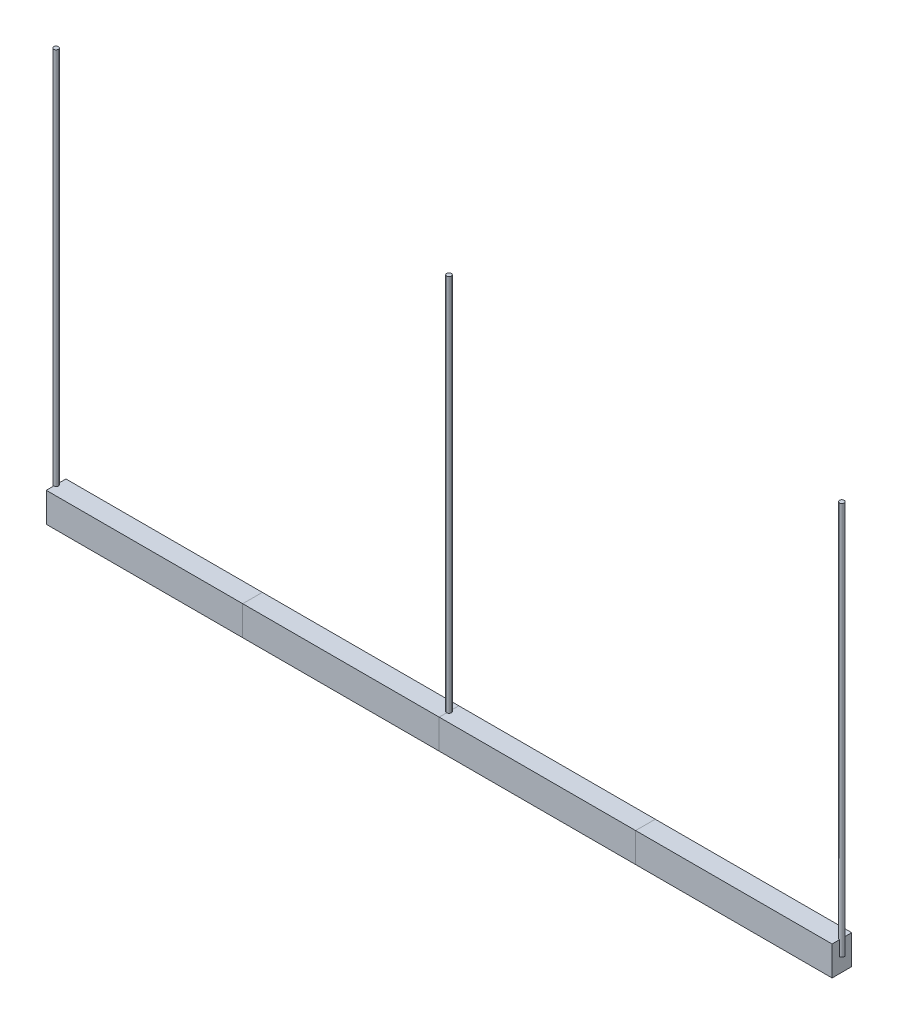
ISO-10303-21;
HEADER;
FILE_DESCRIPTION(('STEP AP214'),'2;1');
FILE_NAME('part.step','',(''),(''),'','','');
FILE_SCHEMA(('AUTOMOTIVE_DESIGN { 1 0 10303 214 1 1 1 1 }'));
ENDSEC;
DATA;
#1=APPLICATION_CONTEXT('core data for automotive mechanical design processes');
#2=APPLICATION_PROTOCOL_DEFINITION('international standard','automotive_design',2000,#1);
#3=PRODUCT_CONTEXT('',#1,'mechanical');
#4=PRODUCT('Part','Part','',(#3));
#5=PRODUCT_RELATED_PRODUCT_CATEGORY('part','',(#4));
#6=PRODUCT_DEFINITION_FORMATION('','',#4);
#7=PRODUCT_DEFINITION_CONTEXT('part definition',#1,'design');
#8=PRODUCT_DEFINITION('design','',#6,#7);
#9=PRODUCT_DEFINITION_SHAPE('','',#8);
#10=(LENGTH_UNIT() NAMED_UNIT(*) SI_UNIT(.MILLI.,.METRE.));
#11=(NAMED_UNIT(*) PLANE_ANGLE_UNIT() SI_UNIT($,.RADIAN.));
#12=(NAMED_UNIT(*) SI_UNIT($,.STERADIAN.) SOLID_ANGLE_UNIT());
#13=UNCERTAINTY_MEASURE_WITH_UNIT(LENGTH_MEASURE(1.E-05),#10,'distance_accuracy_value','');
#14=(GEOMETRIC_REPRESENTATION_CONTEXT(3) GLOBAL_UNCERTAINTY_ASSIGNED_CONTEXT((#13)) GLOBAL_UNIT_ASSIGNED_CONTEXT((#10,
#11,#12)) REPRESENTATION_CONTEXT('',''));
#15=CARTESIAN_POINT('',(0.,0.,0.));
#16=DIRECTION('',(0.,0.,1.));
#17=DIRECTION('',(1.,0.,0.));
#18=AXIS2_PLACEMENT_3D('',#15,#16,#17);
#19=CARTESIAN_POINT('',(4000.,2000.,0.));
#20=DIRECTION('',(0.,-1.,0.));
#21=DIRECTION('',(0.,0.,-1.));
#22=AXIS2_PLACEMENT_3D('',#19,#20,#21);
#23=CYLINDRICAL_SURFACE('',#22,11.9999999999997);
#24=CARTESIAN_POINT('',(4000.,2000.,0.));
#25=DIRECTION('',(0.,1.,0.));
#26=DIRECTION('',(0.,0.,1.));
#27=AXIS2_PLACEMENT_3D('',#24,#25,#26);
#28=CIRCLE('',#27,11.9999999999997);
#29=CARTESIAN_POINT('',(4000.,2000.,11.9999999999997));
#30=VERTEX_POINT('',#29);
#31=EDGE_CURVE('E11',#30,#30,#28,.T.);
#32=ORIENTED_EDGE('',*,*,#31,.F.);
#33=EDGE_LOOP('',(#32));
#34=FACE_BOUND('',#33,.T.);
#35=CARTESIAN_POINT('',(4000.,0.,0.));
#36=DIRECTION('',(0.,1.,0.));
#37=DIRECTION('',(0.,0.,1.));
#38=AXIS2_PLACEMENT_3D('',#35,#36,#37);
#39=CIRCLE('',#38,11.9999999999997);
#40=CARTESIAN_POINT('',(4000.,0.,11.9999999999997));
#41=VERTEX_POINT('',#40);
#42=EDGE_CURVE('E48',#41,#41,#39,.T.);
#43=ORIENTED_EDGE('',*,*,#42,.T.);
#44=EDGE_LOOP('',(#43));
#45=FACE_BOUND('',#44,.T.);
#46=ADVANCED_FACE('F45',(#34,#45),#23,.T.);
#47=CARTESIAN_POINT('',(4000.,2000.,0.));
#48=DIRECTION('',(0.,1.,0.));
#49=DIRECTION('',(0.,0.,1.));
#50=AXIS2_PLACEMENT_3D('',#47,#48,#49);
#51=PLANE('',#50);
#52=ORIENTED_EDGE('',*,*,#31,.T.);
#53=EDGE_LOOP('',(#52));
#54=FACE_BOUND('',#53,.T.);
#55=ADVANCED_FACE('F60',(#54),#51,.T.);
#56=CARTESIAN_POINT('',(4000.,0.,0.));
#57=DIRECTION('',(0.,1.,0.));
#58=DIRECTION('',(0.,0.,1.));
#59=AXIS2_PLACEMENT_3D('',#56,#57,#58);
#60=PLANE('',#59);
#61=ORIENTED_EDGE('',*,*,#42,.F.);
#62=EDGE_LOOP('',(#61));
#63=FACE_BOUND('',#62,.T.);
#64=ADVANCED_FACE('F58',(#63),#60,.F.);
#65=CLOSED_SHELL('',(#46,#55,#64));
#66=MANIFOLD_SOLID_BREP('B2',#65);
#67=CARTESIAN_POINT('',(2000.,2000.,0.));
#68=DIRECTION('',(0.,-1.,0.));
#69=DIRECTION('',(0.,0.,-1.));
#70=AXIS2_PLACEMENT_3D('',#67,#68,#69);
#71=CYLINDRICAL_SURFACE('',#70,12.0000000000002);
#72=CARTESIAN_POINT('',(2000.,2000.,0.));
#73=DIRECTION('',(0.,1.,0.));
#74=DIRECTION('',(0.,0.,1.));
#75=AXIS2_PLACEMENT_3D('',#72,#73,#74);
#76=CIRCLE('',#75,12.0000000000002);
#77=CARTESIAN_POINT('',(2000.,2000.,12.0000000000002));
#78=VERTEX_POINT('',#77);
#79=EDGE_CURVE('E44',#78,#78,#76,.T.);
#80=ORIENTED_EDGE('',*,*,#79,.F.);
#81=EDGE_LOOP('',(#80));
#82=FACE_BOUND('',#81,.T.);
#83=CARTESIAN_POINT('',(2000.,0.,0.));
#84=DIRECTION('',(0.,1.,0.));
#85=DIRECTION('',(0.,0.,1.));
#86=AXIS2_PLACEMENT_3D('',#83,#84,#85);
#87=CIRCLE('',#86,12.0000000000002);
#88=CARTESIAN_POINT('',(2000.,0.,12.0000000000002));
#89=VERTEX_POINT('',#88);
#90=EDGE_CURVE('E96',#89,#89,#87,.T.);
#91=ORIENTED_EDGE('',*,*,#90,.T.);
#92=EDGE_LOOP('',(#91));
#93=FACE_BOUND('',#92,.T.);
#94=ADVANCED_FACE('F93',(#82,#93),#71,.T.);
#95=CARTESIAN_POINT('',(2000.,2000.,0.));
#96=DIRECTION('',(0.,1.,0.));
#97=DIRECTION('',(0.,0.,1.));
#98=AXIS2_PLACEMENT_3D('',#95,#96,#97);
#99=PLANE('',#98);
#100=ORIENTED_EDGE('',*,*,#79,.T.);
#101=EDGE_LOOP('',(#100));
#102=FACE_BOUND('',#101,.T.);
#103=ADVANCED_FACE('F108',(#102),#99,.T.);
#104=CARTESIAN_POINT('',(2000.,0.,0.));
#105=DIRECTION('',(0.,1.,0.));
#106=DIRECTION('',(0.,0.,1.));
#107=AXIS2_PLACEMENT_3D('',#104,#105,#106);
#108=PLANE('',#107);
#109=ORIENTED_EDGE('',*,*,#90,.F.);
#110=EDGE_LOOP('',(#109));
#111=FACE_BOUND('',#110,.T.);
#112=ADVANCED_FACE('F106',(#111),#108,.F.);
#113=CLOSED_SHELL('',(#94,#103,#112));
#114=MANIFOLD_SOLID_BREP('B6',#113);
#115=CARTESIAN_POINT('',(0.,2000.,0.));
#116=DIRECTION('',(0.,-1.,0.));
#117=DIRECTION('',(0.,0.,-1.));
#118=AXIS2_PLACEMENT_3D('',#115,#116,#117);
#119=CYLINDRICAL_SURFACE('',#118,12.);
#120=CARTESIAN_POINT('',(0.,2000.,0.));
#121=DIRECTION('',(0.,1.,0.));
#122=DIRECTION('',(0.,0.,1.));
#123=AXIS2_PLACEMENT_3D('',#120,#121,#122);
#124=CIRCLE('',#123,12.);
#125=CARTESIAN_POINT('',(0.,2000.,12.));
#126=VERTEX_POINT('',#125);
#127=EDGE_CURVE('E92',#126,#126,#124,.T.);
#128=ORIENTED_EDGE('',*,*,#127,.F.);
#129=EDGE_LOOP('',(#128));
#130=FACE_BOUND('',#129,.T.);
#131=CARTESIAN_POINT('',(0.,0.,0.));
#132=DIRECTION('',(0.,1.,0.));
#133=DIRECTION('',(0.,0.,1.));
#134=AXIS2_PLACEMENT_3D('',#131,#132,#133);
#135=CIRCLE('',#134,12.);
#136=CARTESIAN_POINT('',(0.,0.,12.));
#137=VERTEX_POINT('',#136);
#138=EDGE_CURVE('E146',#137,#137,#135,.T.);
#139=ORIENTED_EDGE('',*,*,#138,.T.);
#140=EDGE_LOOP('',(#139));
#141=FACE_BOUND('',#140,.T.);
#142=ADVANCED_FACE('F143',(#130,#141),#119,.T.);
#143=CARTESIAN_POINT('',(0.,2000.,0.));
#144=DIRECTION('',(0.,1.,0.));
#145=DIRECTION('',(0.,0.,1.));
#146=AXIS2_PLACEMENT_3D('',#143,#144,#145);
#147=PLANE('',#146);
#148=ORIENTED_EDGE('',*,*,#127,.T.);
#149=EDGE_LOOP('',(#148));
#150=FACE_BOUND('',#149,.T.);
#151=ADVANCED_FACE('F158',(#150),#147,.T.);
#152=CARTESIAN_POINT('',(0.,0.,0.));
#153=DIRECTION('',(0.,1.,0.));
#154=DIRECTION('',(0.,0.,1.));
#155=AXIS2_PLACEMENT_3D('',#152,#153,#154);
#156=PLANE('',#155);
#157=ORIENTED_EDGE('',*,*,#138,.F.);
#158=EDGE_LOOP('',(#157));
#159=FACE_BOUND('',#158,.T.);
#160=ADVANCED_FACE('F156',(#159),#156,.F.);
#161=CLOSED_SHELL('',(#142,#151,#160));
#162=MANIFOLD_SOLID_BREP('B39',#161);
#163=CARTESIAN_POINT('',(4000.,75.,-50.));
#164=DIRECTION('',(0.,-1.,0.));
#165=DIRECTION('',(0.,0.,-1.));
#166=AXIS2_PLACEMENT_3D('',#163,#164,#165);
#167=PLANE('',#166);
#168=DIRECTION('',(0.,0.,1.));
#169=VECTOR('',#168,1.);
#170=CARTESIAN_POINT('',(3000.,75.,-50.));
#171=LINE('',#170,#169);
#172=CARTESIAN_POINT('',(3000.,75.,-50.));
#173=VERTEX_POINT('',#172);
#174=CARTESIAN_POINT('',(3000.,75.,50.));
#175=VERTEX_POINT('',#174);
#176=EDGE_CURVE('E256',#173,#175,#171,.T.);
#177=ORIENTED_EDGE('',*,*,#176,.T.);
#178=DIRECTION('',(-1.,0.,0.));
#179=VECTOR('',#178,1.);
#180=CARTESIAN_POINT('',(4000.,75.,50.));
#181=LINE('',#180,#179);
#182=CARTESIAN_POINT('',(4000.,75.,50.));
#183=VERTEX_POINT('',#182);
#184=EDGE_CURVE('E141',#183,#175,#181,.T.);
#185=ORIENTED_EDGE('',*,*,#184,.F.);
#186=DIRECTION('',(0.,0.,1.));
#187=VECTOR('',#186,1.);
#188=CARTESIAN_POINT('',(4000.,75.,-50.));
#189=LINE('',#188,#187);
#190=CARTESIAN_POINT('',(4000.,75.,-50.));
#191=VERTEX_POINT('',#190);
#192=EDGE_CURVE('E244',#191,#183,#189,.T.);
#193=ORIENTED_EDGE('',*,*,#192,.F.);
#194=DIRECTION('',(-1.,0.,0.));
#195=VECTOR('',#194,1.);
#196=CARTESIAN_POINT('',(4000.,75.,-50.));
#197=LINE('',#196,#195);
#198=EDGE_CURVE('E252',#191,#173,#197,.T.);
#199=ORIENTED_EDGE('',*,*,#198,.T.);
#200=EDGE_LOOP('',(#177,#185,#193,#199));
#201=FACE_BOUND('',#200,.T.);
#202=ADVANCED_FACE('F193',(#201),#167,.F.);
#203=CARTESIAN_POINT('',(4000.,75.,50.));
#204=DIRECTION('',(0.,0.,-1.));
#205=DIRECTION('',(0.,1.,0.));
#206=AXIS2_PLACEMENT_3D('',#203,#204,#205);
#207=PLANE('',#206);
#208=DIRECTION('',(0.,-1.,0.));
#209=VECTOR('',#208,1.);
#210=CARTESIAN_POINT('',(3000.,75.,50.));
#211=LINE('',#210,#209);
#212=CARTESIAN_POINT('',(3000.,-75.,50.));
#213=VERTEX_POINT('',#212);
#214=EDGE_CURVE('E248',#175,#213,#211,.T.);
#215=ORIENTED_EDGE('',*,*,#214,.T.);
#216=DIRECTION('',(-1.,0.,0.));
#217=VECTOR('',#216,1.);
#218=CARTESIAN_POINT('',(4000.,-75.,50.));
#219=LINE('',#218,#217);
#220=CARTESIAN_POINT('',(4000.,-75.,50.));
#221=VERTEX_POINT('',#220);
#222=EDGE_CURVE('E201',#221,#213,#219,.T.);
#223=ORIENTED_EDGE('',*,*,#222,.F.);
#224=DIRECTION('',(0.,-1.,0.));
#225=VECTOR('',#224,1.);
#226=CARTESIAN_POINT('',(4000.,75.,50.));
#227=LINE('',#226,#225);
#228=EDGE_CURVE('E239',#183,#221,#227,.T.);
#229=ORIENTED_EDGE('',*,*,#228,.F.);
#230=ORIENTED_EDGE('',*,*,#184,.T.);
#231=EDGE_LOOP('',(#215,#223,#229,#230));
#232=FACE_BOUND('',#231,.T.);
#233=ADVANCED_FACE('F247',(#232),#207,.F.);
#234=CARTESIAN_POINT('',(4000.,-75.,50.));
#235=DIRECTION('',(0.,1.,0.));
#236=DIRECTION('',(0.,0.,1.));
#237=AXIS2_PLACEMENT_3D('',#234,#235,#236);
#238=PLANE('',#237);
#239=DIRECTION('',(0.,0.,-1.));
#240=VECTOR('',#239,1.);
#241=CARTESIAN_POINT('',(3000.,-75.,50.));
#242=LINE('',#241,#240);
#243=CARTESIAN_POINT('',(3000.,-75.,-50.));
#244=VERTEX_POINT('',#243);
#245=EDGE_CURVE('E226',#213,#244,#242,.T.);
#246=ORIENTED_EDGE('',*,*,#245,.T.);
#247=DIRECTION('',(-1.,0.,0.));
#248=VECTOR('',#247,1.);
#249=CARTESIAN_POINT('',(4000.,-75.,-50.));
#250=LINE('',#249,#248);
#251=CARTESIAN_POINT('',(4000.,-75.,-50.));
#252=VERTEX_POINT('',#251);
#253=EDGE_CURVE('E249',#252,#244,#250,.T.);
#254=ORIENTED_EDGE('',*,*,#253,.F.);
#255=DIRECTION('',(0.,0.,-1.));
#256=VECTOR('',#255,1.);
#257=CARTESIAN_POINT('',(4000.,-75.,50.));
#258=LINE('',#257,#256);
#259=EDGE_CURVE('E242',#221,#252,#258,.T.);
#260=ORIENTED_EDGE('',*,*,#259,.F.);
#261=ORIENTED_EDGE('',*,*,#222,.T.);
#262=EDGE_LOOP('',(#246,#254,#260,#261));
#263=FACE_BOUND('',#262,.T.);
#264=ADVANCED_FACE('F250',(#263),#238,.F.);
#265=CARTESIAN_POINT('',(4000.,-75.,-50.));
#266=DIRECTION('',(0.,0.,1.));
#267=DIRECTION('',(0.,-1.,0.));
#268=AXIS2_PLACEMENT_3D('',#265,#266,#267);
#269=PLANE('',#268);
#270=DIRECTION('',(0.,1.,0.));
#271=VECTOR('',#270,1.);
#272=CARTESIAN_POINT('',(3000.,-75.,-50.));
#273=LINE('',#272,#271);
#274=EDGE_CURVE('E232',#244,#173,#273,.T.);
#275=ORIENTED_EDGE('',*,*,#274,.T.);
#276=ORIENTED_EDGE('',*,*,#198,.F.);
#277=DIRECTION('',(0.,1.,0.));
#278=VECTOR('',#277,1.);
#279=CARTESIAN_POINT('',(4000.,-75.,-50.));
#280=LINE('',#279,#278);
#281=EDGE_CURVE('E209',#252,#191,#280,.T.);
#282=ORIENTED_EDGE('',*,*,#281,.F.);
#283=ORIENTED_EDGE('',*,*,#253,.T.);
#284=EDGE_LOOP('',(#275,#276,#282,#283));
#285=FACE_BOUND('',#284,.T.);
#286=ADVANCED_FACE('F263',(#285),#269,.F.);
#287=CARTESIAN_POINT('',(4000.,0.,0.));
#288=DIRECTION('',(1.,0.,0.));
#289=DIRECTION('',(0.,0.,-1.));
#290=AXIS2_PLACEMENT_3D('',#287,#288,#289);
#291=PLANE('',#290);
#292=ORIENTED_EDGE('',*,*,#192,.T.);
#293=ORIENTED_EDGE('',*,*,#228,.T.);
#294=ORIENTED_EDGE('',*,*,#259,.T.);
#295=ORIENTED_EDGE('',*,*,#281,.T.);
#296=EDGE_LOOP('',(#292,#293,#294,#295));
#297=FACE_BOUND('',#296,.T.);
#298=ADVANCED_FACE('F240',(#297),#291,.T.);
#299=CARTESIAN_POINT('',(3000.,0.,0.));
#300=DIRECTION('',(1.,0.,0.));
#301=DIRECTION('',(0.,0.,-1.));
#302=AXIS2_PLACEMENT_3D('',#299,#300,#301);
#303=PLANE('',#302);
#304=ORIENTED_EDGE('',*,*,#176,.F.);
#305=ORIENTED_EDGE('',*,*,#274,.F.);
#306=ORIENTED_EDGE('',*,*,#245,.F.);
#307=ORIENTED_EDGE('',*,*,#214,.F.);
#308=EDGE_LOOP('',(#304,#305,#306,#307));
#309=FACE_BOUND('',#308,.T.);
#310=ADVANCED_FACE('F266',(#309),#303,.F.);
#311=CLOSED_SHELL('',(#202,#233,#264,#286,#298,#310));
#312=MANIFOLD_SOLID_BREP('B87',#311);
#313=CARTESIAN_POINT('',(3000.,75.,50.));
#314=DIRECTION('',(0.,0.,-1.));
#315=DIRECTION('',(0.,1.,0.));
#316=AXIS2_PLACEMENT_3D('',#313,#314,#315);
#317=PLANE('',#316);
#318=DIRECTION('',(0.,-1.,0.));
#319=VECTOR('',#318,1.);
#320=CARTESIAN_POINT('',(2000.,75.,50.));
#321=LINE('',#320,#319);
#322=CARTESIAN_POINT('',(2000.,75.,50.));
#323=VERTEX_POINT('',#322);
#324=CARTESIAN_POINT('',(2000.,-75.,50.));
#325=VERTEX_POINT('',#324);
#326=EDGE_CURVE('E389',#323,#325,#321,.T.);
#327=ORIENTED_EDGE('',*,*,#326,.T.);
#328=DIRECTION('',(-1.,0.,0.));
#329=VECTOR('',#328,1.);
#330=CARTESIAN_POINT('',(3000.,-75.,50.));
#331=LINE('',#330,#329);
#332=CARTESIAN_POINT('',(3000.,-75.,50.));
#333=VERTEX_POINT('',#332);
#334=EDGE_CURVE('E191',#333,#325,#331,.T.);
#335=ORIENTED_EDGE('',*,*,#334,.F.);
#336=DIRECTION('',(0.,-1.,0.));
#337=VECTOR('',#336,1.);
#338=CARTESIAN_POINT('',(3000.,75.,50.));
#339=LINE('',#338,#337);
#340=CARTESIAN_POINT('',(3000.,75.,50.));
#341=VERTEX_POINT('',#340);
#342=EDGE_CURVE('E377',#341,#333,#339,.T.);
#343=ORIENTED_EDGE('',*,*,#342,.F.);
#344=DIRECTION('',(-1.,0.,0.));
#345=VECTOR('',#344,1.);
#346=CARTESIAN_POINT('',(3000.,75.,50.));
#347=LINE('',#346,#345);
#348=EDGE_CURVE('E385',#341,#323,#347,.T.);
#349=ORIENTED_EDGE('',*,*,#348,.T.);
#350=EDGE_LOOP('',(#327,#335,#343,#349));
#351=FACE_BOUND('',#350,.T.);
#352=ADVANCED_FACE('F326',(#351),#317,.F.);
#353=CARTESIAN_POINT('',(3000.,-75.,50.));
#354=DIRECTION('',(0.,1.,0.));
#355=DIRECTION('',(0.,0.,1.));
#356=AXIS2_PLACEMENT_3D('',#353,#354,#355);
#357=PLANE('',#356);
#358=DIRECTION('',(0.,0.,-1.));
#359=VECTOR('',#358,1.);
#360=CARTESIAN_POINT('',(2000.,-75.,50.));
#361=LINE('',#360,#359);
#362=CARTESIAN_POINT('',(2000.,-75.,-50.));
#363=VERTEX_POINT('',#362);
#364=EDGE_CURVE('E381',#325,#363,#361,.T.);
#365=ORIENTED_EDGE('',*,*,#364,.T.);
#366=DIRECTION('',(-1.,0.,0.));
#367=VECTOR('',#366,1.);
#368=CARTESIAN_POINT('',(3000.,-75.,-50.));
#369=LINE('',#368,#367);
#370=CARTESIAN_POINT('',(3000.,-75.,-50.));
#371=VERTEX_POINT('',#370);
#372=EDGE_CURVE('E334',#371,#363,#369,.T.);
#373=ORIENTED_EDGE('',*,*,#372,.F.);
#374=DIRECTION('',(0.,0.,-1.));
#375=VECTOR('',#374,1.);
#376=CARTESIAN_POINT('',(3000.,-75.,50.));
#377=LINE('',#376,#375);
#378=EDGE_CURVE('E372',#333,#371,#377,.T.);
#379=ORIENTED_EDGE('',*,*,#378,.F.);
#380=ORIENTED_EDGE('',*,*,#334,.T.);
#381=EDGE_LOOP('',(#365,#373,#379,#380));
#382=FACE_BOUND('',#381,.T.);
#383=ADVANCED_FACE('F380',(#382),#357,.F.);
#384=CARTESIAN_POINT('',(3000.,-75.,-50.));
#385=DIRECTION('',(0.,0.,1.));
#386=DIRECTION('',(0.,-1.,0.));
#387=AXIS2_PLACEMENT_3D('',#384,#385,#386);
#388=PLANE('',#387);
#389=DIRECTION('',(0.,1.,0.));
#390=VECTOR('',#389,1.);
#391=CARTESIAN_POINT('',(2000.,-75.,-50.));
#392=LINE('',#391,#390);
#393=CARTESIAN_POINT('',(2000.,75.,-50.));
#394=VERTEX_POINT('',#393);
#395=EDGE_CURVE('E359',#363,#394,#392,.T.);
#396=ORIENTED_EDGE('',*,*,#395,.T.);
#397=DIRECTION('',(-1.,0.,0.));
#398=VECTOR('',#397,1.);
#399=CARTESIAN_POINT('',(3000.,75.,-50.));
#400=LINE('',#399,#398);
#401=CARTESIAN_POINT('',(3000.,75.,-50.));
#402=VERTEX_POINT('',#401);
#403=EDGE_CURVE('E382',#402,#394,#400,.T.);
#404=ORIENTED_EDGE('',*,*,#403,.F.);
#405=DIRECTION('',(0.,1.,0.));
#406=VECTOR('',#405,1.);
#407=CARTESIAN_POINT('',(3000.,-75.,-50.));
#408=LINE('',#407,#406);
#409=EDGE_CURVE('E375',#371,#402,#408,.T.);
#410=ORIENTED_EDGE('',*,*,#409,.F.);
#411=ORIENTED_EDGE('',*,*,#372,.T.);
#412=EDGE_LOOP('',(#396,#404,#410,#411));
#413=FACE_BOUND('',#412,.T.);
#414=ADVANCED_FACE('F383',(#413),#388,.F.);
#415=CARTESIAN_POINT('',(3000.,75.,-50.));
#416=DIRECTION('',(0.,-1.,0.));
#417=DIRECTION('',(0.,0.,-1.));
#418=AXIS2_PLACEMENT_3D('',#415,#416,#417);
#419=PLANE('',#418);
#420=DIRECTION('',(0.,0.,1.));
#421=VECTOR('',#420,1.);
#422=CARTESIAN_POINT('',(2000.,75.,-50.));
#423=LINE('',#422,#421);
#424=EDGE_CURVE('E365',#394,#323,#423,.T.);
#425=ORIENTED_EDGE('',*,*,#424,.T.);
#426=ORIENTED_EDGE('',*,*,#348,.F.);
#427=DIRECTION('',(0.,0.,1.));
#428=VECTOR('',#427,1.);
#429=CARTESIAN_POINT('',(3000.,75.,-50.));
#430=LINE('',#429,#428);
#431=EDGE_CURVE('E342',#402,#341,#430,.T.);
#432=ORIENTED_EDGE('',*,*,#431,.F.);
#433=ORIENTED_EDGE('',*,*,#403,.T.);
#434=EDGE_LOOP('',(#425,#426,#432,#433));
#435=FACE_BOUND('',#434,.T.);
#436=ADVANCED_FACE('F396',(#435),#419,.F.);
#437=CARTESIAN_POINT('',(3000.,0.,0.));
#438=DIRECTION('',(1.,0.,0.));
#439=DIRECTION('',(0.,0.,-1.));
#440=AXIS2_PLACEMENT_3D('',#437,#438,#439);
#441=PLANE('',#440);
#442=ORIENTED_EDGE('',*,*,#342,.T.);
#443=ORIENTED_EDGE('',*,*,#378,.T.);
#444=ORIENTED_EDGE('',*,*,#409,.T.);
#445=ORIENTED_EDGE('',*,*,#431,.T.);
#446=EDGE_LOOP('',(#442,#443,#444,#445));
#447=FACE_BOUND('',#446,.T.);
#448=ADVANCED_FACE('F373',(#447),#441,.T.);
#449=CARTESIAN_POINT('',(2000.,0.,0.));
#450=DIRECTION('',(1.,0.,0.));
#451=DIRECTION('',(0.,0.,-1.));
#452=AXIS2_PLACEMENT_3D('',#449,#450,#451);
#453=PLANE('',#452);
#454=ORIENTED_EDGE('',*,*,#326,.F.);
#455=ORIENTED_EDGE('',*,*,#424,.F.);
#456=ORIENTED_EDGE('',*,*,#395,.F.);
#457=ORIENTED_EDGE('',*,*,#364,.F.);
#458=EDGE_LOOP('',(#454,#455,#456,#457));
#459=FACE_BOUND('',#458,.T.);
#460=ADVANCED_FACE('F399',(#459),#453,.F.);
#461=CLOSED_SHELL('',(#352,#383,#414,#436,#448,#460));
#462=MANIFOLD_SOLID_BREP('B135',#461);
#463=CARTESIAN_POINT('',(2000.,-75.,50.));
#464=DIRECTION('',(0.,1.,0.));
#465=DIRECTION('',(0.,0.,1.));
#466=AXIS2_PLACEMENT_3D('',#463,#464,#465);
#467=PLANE('',#466);
#468=DIRECTION('',(0.,0.,-1.));
#469=VECTOR('',#468,1.);
#470=CARTESIAN_POINT('',(1000.,-75.,50.));
#471=LINE('',#470,#469);
#472=CARTESIAN_POINT('',(1000.,-75.,50.));
#473=VERTEX_POINT('',#472);
#474=CARTESIAN_POINT('',(1000.,-75.,-50.));
#475=VERTEX_POINT('',#474);
#476=EDGE_CURVE('E521',#473,#475,#471,.T.);
#477=ORIENTED_EDGE('',*,*,#476,.T.);
#478=DIRECTION('',(-1.,0.,0.));
#479=VECTOR('',#478,1.);
#480=CARTESIAN_POINT('',(2000.,-75.,-50.));
#481=LINE('',#480,#479);
#482=CARTESIAN_POINT('',(2000.,-75.,-50.));
#483=VERTEX_POINT('',#482);
#484=EDGE_CURVE('E324',#483,#475,#481,.T.);
#485=ORIENTED_EDGE('',*,*,#484,.F.);
#486=DIRECTION('',(0.,0.,-1.));
#487=VECTOR('',#486,1.);
#488=CARTESIAN_POINT('',(2000.,-75.,50.));
#489=LINE('',#488,#487);
#490=CARTESIAN_POINT('',(2000.,-75.,50.));
#491=VERTEX_POINT('',#490);
#492=EDGE_CURVE('E509',#491,#483,#489,.T.);
#493=ORIENTED_EDGE('',*,*,#492,.F.);
#494=DIRECTION('',(-1.,0.,0.));
#495=VECTOR('',#494,1.);
#496=CARTESIAN_POINT('',(2000.,-75.,50.));
#497=LINE('',#496,#495);
#498=EDGE_CURVE('E517',#491,#473,#497,.T.);
#499=ORIENTED_EDGE('',*,*,#498,.T.);
#500=EDGE_LOOP('',(#477,#485,#493,#499));
#501=FACE_BOUND('',#500,.T.);
#502=ADVANCED_FACE('F458',(#501),#467,.F.);
#503=CARTESIAN_POINT('',(2000.,-75.,-50.));
#504=DIRECTION('',(0.,0.,1.));
#505=DIRECTION('',(0.,-1.,0.));
#506=AXIS2_PLACEMENT_3D('',#503,#504,#505);
#507=PLANE('',#506);
#508=DIRECTION('',(0.,1.,0.));
#509=VECTOR('',#508,1.);
#510=CARTESIAN_POINT('',(1000.,-75.,-50.));
#511=LINE('',#510,#509);
#512=CARTESIAN_POINT('',(1000.,75.,-50.));
#513=VERTEX_POINT('',#512);
#514=EDGE_CURVE('E513',#475,#513,#511,.T.);
#515=ORIENTED_EDGE('',*,*,#514,.T.);
#516=DIRECTION('',(-1.,0.,0.));
#517=VECTOR('',#516,1.);
#518=CARTESIAN_POINT('',(2000.,75.,-50.));
#519=LINE('',#518,#517);
#520=CARTESIAN_POINT('',(2000.,75.,-50.));
#521=VERTEX_POINT('',#520);
#522=EDGE_CURVE('E466',#521,#513,#519,.T.);
#523=ORIENTED_EDGE('',*,*,#522,.F.);
#524=DIRECTION('',(0.,1.,0.));
#525=VECTOR('',#524,1.);
#526=CARTESIAN_POINT('',(2000.,-75.,-50.));
#527=LINE('',#526,#525);
#528=EDGE_CURVE('E504',#483,#521,#527,.T.);
#529=ORIENTED_EDGE('',*,*,#528,.F.);
#530=ORIENTED_EDGE('',*,*,#484,.T.);
#531=EDGE_LOOP('',(#515,#523,#529,#530));
#532=FACE_BOUND('',#531,.T.);
#533=ADVANCED_FACE('F512',(#532),#507,.F.);
#534=CARTESIAN_POINT('',(2000.,75.,-50.));
#535=DIRECTION('',(0.,-1.,0.));
#536=DIRECTION('',(0.,0.,-1.));
#537=AXIS2_PLACEMENT_3D('',#534,#535,#536);
#538=PLANE('',#537);
#539=DIRECTION('',(0.,0.,1.));
#540=VECTOR('',#539,1.);
#541=CARTESIAN_POINT('',(1000.,75.,-50.));
#542=LINE('',#541,#540);
#543=CARTESIAN_POINT('',(1000.,75.,50.));
#544=VERTEX_POINT('',#543);
#545=EDGE_CURVE('E491',#513,#544,#542,.T.);
#546=ORIENTED_EDGE('',*,*,#545,.T.);
#547=DIRECTION('',(-1.,0.,0.));
#548=VECTOR('',#547,1.);
#549=CARTESIAN_POINT('',(2000.,75.,50.));
#550=LINE('',#549,#548);
#551=CARTESIAN_POINT('',(2000.,75.,50.));
#552=VERTEX_POINT('',#551);
#553=EDGE_CURVE('E514',#552,#544,#550,.T.);
#554=ORIENTED_EDGE('',*,*,#553,.F.);
#555=DIRECTION('',(0.,0.,1.));
#556=VECTOR('',#555,1.);
#557=CARTESIAN_POINT('',(2000.,75.,-50.));
#558=LINE('',#557,#556);
#559=EDGE_CURVE('E507',#521,#552,#558,.T.);
#560=ORIENTED_EDGE('',*,*,#559,.F.);
#561=ORIENTED_EDGE('',*,*,#522,.T.);
#562=EDGE_LOOP('',(#546,#554,#560,#561));
#563=FACE_BOUND('',#562,.T.);
#564=ADVANCED_FACE('F515',(#563),#538,.F.);
#565=CARTESIAN_POINT('',(2000.,75.,50.));
#566=DIRECTION('',(0.,0.,-1.));
#567=DIRECTION('',(0.,1.,0.));
#568=AXIS2_PLACEMENT_3D('',#565,#566,#567);
#569=PLANE('',#568);
#570=DIRECTION('',(0.,-1.,0.));
#571=VECTOR('',#570,1.);
#572=CARTESIAN_POINT('',(1000.,75.,50.));
#573=LINE('',#572,#571);
#574=EDGE_CURVE('E497',#544,#473,#573,.T.);
#575=ORIENTED_EDGE('',*,*,#574,.T.);
#576=ORIENTED_EDGE('',*,*,#498,.F.);
#577=DIRECTION('',(0.,-1.,0.));
#578=VECTOR('',#577,1.);
#579=CARTESIAN_POINT('',(2000.,75.,50.));
#580=LINE('',#579,#578);
#581=EDGE_CURVE('E474',#552,#491,#580,.T.);
#582=ORIENTED_EDGE('',*,*,#581,.F.);
#583=ORIENTED_EDGE('',*,*,#553,.T.);
#584=EDGE_LOOP('',(#575,#576,#582,#583));
#585=FACE_BOUND('',#584,.T.);
#586=ADVANCED_FACE('F528',(#585),#569,.F.);
#587=CARTESIAN_POINT('',(2000.,0.,0.));
#588=DIRECTION('',(1.,0.,0.));
#589=DIRECTION('',(0.,0.,-1.));
#590=AXIS2_PLACEMENT_3D('',#587,#588,#589);
#591=PLANE('',#590);
#592=ORIENTED_EDGE('',*,*,#492,.T.);
#593=ORIENTED_EDGE('',*,*,#528,.T.);
#594=ORIENTED_EDGE('',*,*,#559,.T.);
#595=ORIENTED_EDGE('',*,*,#581,.T.);
#596=EDGE_LOOP('',(#592,#593,#594,#595));
#597=FACE_BOUND('',#596,.T.);
#598=ADVANCED_FACE('F505',(#597),#591,.T.);
#599=CARTESIAN_POINT('',(1000.,0.,0.));
#600=DIRECTION('',(1.,0.,0.));
#601=DIRECTION('',(0.,0.,-1.));
#602=AXIS2_PLACEMENT_3D('',#599,#600,#601);
#603=PLANE('',#602);
#604=ORIENTED_EDGE('',*,*,#476,.F.);
#605=ORIENTED_EDGE('',*,*,#574,.F.);
#606=ORIENTED_EDGE('',*,*,#545,.F.);
#607=ORIENTED_EDGE('',*,*,#514,.F.);
#608=EDGE_LOOP('',(#604,#605,#606,#607));
#609=FACE_BOUND('',#608,.T.);
#610=ADVANCED_FACE('F531',(#609),#603,.F.);
#611=CLOSED_SHELL('',(#502,#533,#564,#586,#598,#610));
#612=MANIFOLD_SOLID_BREP('B185',#611);
#613=CARTESIAN_POINT('',(1000.,75.,-50.));
#614=DIRECTION('',(0.,0.,1.));
#615=DIRECTION('',(0.,-1.,0.));
#616=AXIS2_PLACEMENT_3D('',#613,#614,#615);
#617=PLANE('',#616);
#618=DIRECTION('',(0.,1.,0.));
#619=VECTOR('',#618,1.);
#620=CARTESIAN_POINT('',(0.,75.,-50.));
#621=LINE('',#620,#619);
#622=CARTESIAN_POINT('',(0.,-75.,-50.));
#623=VERTEX_POINT('',#622);
#624=CARTESIAN_POINT('',(0.,75.,-50.));
#625=VERTEX_POINT('',#624);
#626=EDGE_CURVE('E644',#623,#625,#621,.T.);
#627=ORIENTED_EDGE('',*,*,#626,.T.);
#628=DIRECTION('',(-1.,0.,0.));
#629=VECTOR('',#628,1.);
#630=CARTESIAN_POINT('',(1000.,75.,-50.));
#631=LINE('',#630,#629);
#632=CARTESIAN_POINT('',(1000.,75.,-50.));
#633=VERTEX_POINT('',#632);
#634=EDGE_CURVE('E456',#633,#625,#631,.T.);
#635=ORIENTED_EDGE('',*,*,#634,.F.);
#636=DIRECTION('',(0.,1.,0.));
#637=VECTOR('',#636,1.);
#638=CARTESIAN_POINT('',(1000.,75.,-50.));
#639=LINE('',#638,#637);
#640=CARTESIAN_POINT('',(1000.,-75.,-50.));
#641=VERTEX_POINT('',#640);
#642=EDGE_CURVE('E632',#641,#633,#639,.T.);
#643=ORIENTED_EDGE('',*,*,#642,.F.);
#644=DIRECTION('',(-1.,0.,0.));
#645=VECTOR('',#644,1.);
#646=CARTESIAN_POINT('',(1000.,-75.,-50.));
#647=LINE('',#646,#645);
#648=EDGE_CURVE('E640',#641,#623,#647,.T.);
#649=ORIENTED_EDGE('',*,*,#648,.T.);
#650=EDGE_LOOP('',(#627,#635,#643,#649));
#651=FACE_BOUND('',#650,.T.);
#652=ADVANCED_FACE('F581',(#651),#617,.F.);
#653=CARTESIAN_POINT('',(1000.,75.,50.));
#654=DIRECTION('',(0.,-1.,0.));
#655=DIRECTION('',(0.,0.,-1.));
#656=AXIS2_PLACEMENT_3D('',#653,#654,#655);
#657=PLANE('',#656);
#658=DIRECTION('',(0.,0.,1.));
#659=VECTOR('',#658,1.);
#660=CARTESIAN_POINT('',(0.,75.,50.));
#661=LINE('',#660,#659);
#662=CARTESIAN_POINT('',(0.,75.,50.));
#663=VERTEX_POINT('',#662);
#664=EDGE_CURVE('E636',#625,#663,#661,.T.);
#665=ORIENTED_EDGE('',*,*,#664,.T.);
#666=DIRECTION('',(-1.,0.,0.));
#667=VECTOR('',#666,1.);
#668=CARTESIAN_POINT('',(1000.,75.,50.));
#669=LINE('',#668,#667);
#670=CARTESIAN_POINT('',(1000.,75.,50.));
#671=VERTEX_POINT('',#670);
#672=EDGE_CURVE('E589',#671,#663,#669,.T.);
#673=ORIENTED_EDGE('',*,*,#672,.F.);
#674=DIRECTION('',(0.,0.,1.));
#675=VECTOR('',#674,1.);
#676=CARTESIAN_POINT('',(1000.,75.,50.));
#677=LINE('',#676,#675);
#678=EDGE_CURVE('E627',#633,#671,#677,.T.);
#679=ORIENTED_EDGE('',*,*,#678,.F.);
#680=ORIENTED_EDGE('',*,*,#634,.T.);
#681=EDGE_LOOP('',(#665,#673,#679,#680));
#682=FACE_BOUND('',#681,.T.);
#683=ADVANCED_FACE('F635',(#682),#657,.F.);
#684=CARTESIAN_POINT('',(1000.,75.,50.));
#685=DIRECTION('',(0.,0.,-1.));
#686=DIRECTION('',(0.,1.,0.));
#687=AXIS2_PLACEMENT_3D('',#684,#685,#686);
#688=PLANE('',#687);
#689=DIRECTION('',(0.,-1.,0.));
#690=VECTOR('',#689,1.);
#691=CARTESIAN_POINT('',(0.,75.,50.));
#692=LINE('',#691,#690);
#693=CARTESIAN_POINT('',(0.,-75.,50.));
#694=VERTEX_POINT('',#693);
#695=EDGE_CURVE('E614',#663,#694,#692,.T.);
#696=ORIENTED_EDGE('',*,*,#695,.T.);
#697=DIRECTION('',(-1.,0.,0.));
#698=VECTOR('',#697,1.);
#699=CARTESIAN_POINT('',(1000.,-75.,50.));
#700=LINE('',#699,#698);
#701=CARTESIAN_POINT('',(1000.,-75.,50.));
#702=VERTEX_POINT('',#701);
#703=EDGE_CURVE('E637',#702,#694,#700,.T.);
#704=ORIENTED_EDGE('',*,*,#703,.F.);
#705=DIRECTION('',(0.,-1.,0.));
#706=VECTOR('',#705,1.);
#707=CARTESIAN_POINT('',(1000.,75.,50.));
#708=LINE('',#707,#706);
#709=EDGE_CURVE('E630',#671,#702,#708,.T.);
#710=ORIENTED_EDGE('',*,*,#709,.F.);
#711=ORIENTED_EDGE('',*,*,#672,.T.);
#712=EDGE_LOOP('',(#696,#704,#710,#711));
#713=FACE_BOUND('',#712,.T.);
#714=ADVANCED_FACE('F638',(#713),#688,.F.);
#715=CARTESIAN_POINT('',(1000.,-75.,50.));
#716=DIRECTION('',(0.,1.,0.));
#717=DIRECTION('',(0.,0.,1.));
#718=AXIS2_PLACEMENT_3D('',#715,#716,#717);
#719=PLANE('',#718);
#720=DIRECTION('',(0.,0.,-1.));
#721=VECTOR('',#720,1.);
#722=CARTESIAN_POINT('',(0.,-75.,50.));
#723=LINE('',#722,#721);
#724=EDGE_CURVE('E620',#694,#623,#723,.T.);
#725=ORIENTED_EDGE('',*,*,#724,.T.);
#726=ORIENTED_EDGE('',*,*,#648,.F.);
#727=DIRECTION('',(0.,0.,-1.));
#728=VECTOR('',#727,1.);
#729=CARTESIAN_POINT('',(1000.,-75.,50.));
#730=LINE('',#729,#728);
#731=EDGE_CURVE('E597',#702,#641,#730,.T.);
#732=ORIENTED_EDGE('',*,*,#731,.F.);
#733=ORIENTED_EDGE('',*,*,#703,.T.);
#734=EDGE_LOOP('',(#725,#726,#732,#733));
#735=FACE_BOUND('',#734,.T.);
#736=ADVANCED_FACE('F651',(#735),#719,.F.);
#737=CARTESIAN_POINT('',(1000.,0.,0.));
#738=DIRECTION('',(1.,0.,0.));
#739=DIRECTION('',(0.,0.,-1.));
#740=AXIS2_PLACEMENT_3D('',#737,#738,#739);
#741=PLANE('',#740);
#742=ORIENTED_EDGE('',*,*,#642,.T.);
#743=ORIENTED_EDGE('',*,*,#678,.T.);
#744=ORIENTED_EDGE('',*,*,#709,.T.);
#745=ORIENTED_EDGE('',*,*,#731,.T.);
#746=EDGE_LOOP('',(#742,#743,#744,#745));
#747=FACE_BOUND('',#746,.T.);
#748=ADVANCED_FACE('F628',(#747),#741,.T.);
#749=CARTESIAN_POINT('',(0.,0.,0.));
#750=DIRECTION('',(1.,0.,0.));
#751=DIRECTION('',(0.,0.,-1.));
#752=AXIS2_PLACEMENT_3D('',#749,#750,#751);
#753=PLANE('',#752);
#754=ORIENTED_EDGE('',*,*,#626,.F.);
#755=ORIENTED_EDGE('',*,*,#724,.F.);
#756=ORIENTED_EDGE('',*,*,#695,.F.);
#757=ORIENTED_EDGE('',*,*,#664,.F.);
#758=EDGE_LOOP('',(#754,#755,#756,#757));
#759=FACE_BOUND('',#758,.T.);
#760=ADVANCED_FACE('F654',(#759),#753,.F.);
#761=CLOSED_SHELL('',(#652,#683,#714,#736,#748,#760));
#762=MANIFOLD_SOLID_BREP('B318',#761);
#763=ADVANCED_BREP_SHAPE_REPRESENTATION('',(#18,#66,#114,#162,#312,#462,#612,#762),#14);
#764=SHAPE_DEFINITION_REPRESENTATION(#9,#763);
ENDSEC;
END-ISO-10303-21;
